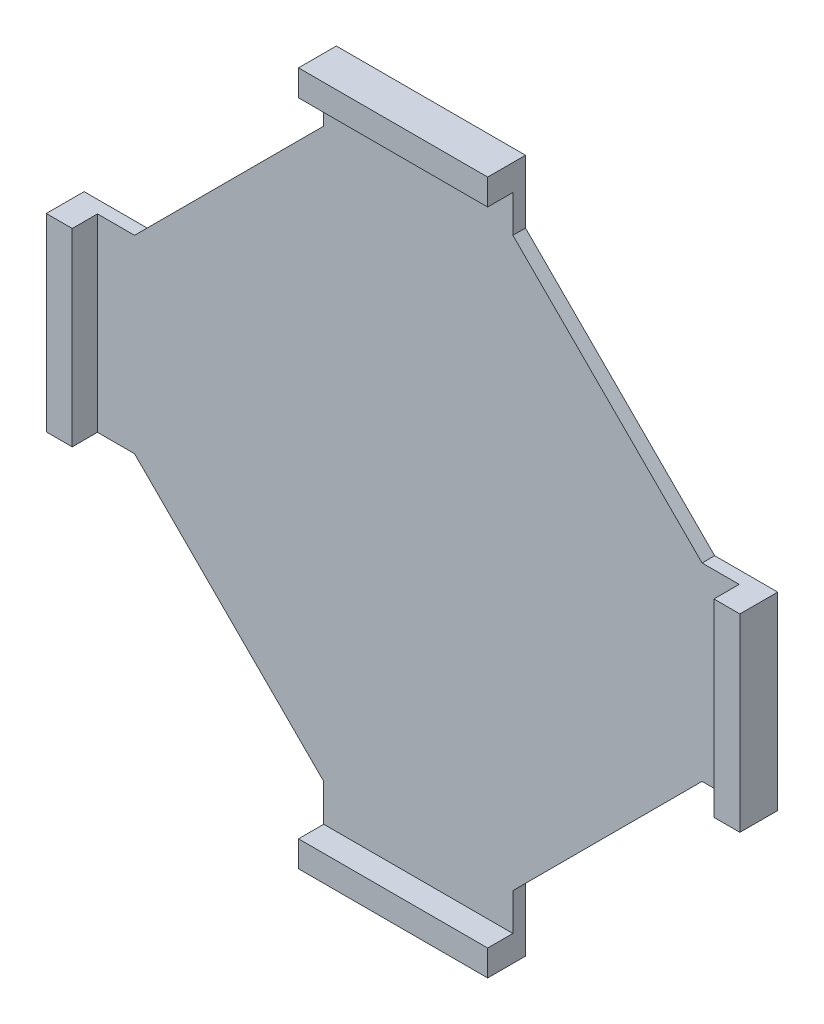
ISO-10303-21;
HEADER;
FILE_DESCRIPTION(('STEP AP214'),'2;1');
FILE_NAME('part.step','',(''),(''),'','','');
FILE_SCHEMA(('AUTOMOTIVE_DESIGN { 1 0 10303 214 1 1 1 1 }'));
ENDSEC;
DATA;
#1=APPLICATION_CONTEXT('core data for automotive mechanical design processes');
#2=APPLICATION_PROTOCOL_DEFINITION('international standard','automotive_design',2000,#1);
#3=PRODUCT_CONTEXT('',#1,'mechanical');
#4=PRODUCT('Part','Part','',(#3));
#5=PRODUCT_RELATED_PRODUCT_CATEGORY('part','',(#4));
#6=PRODUCT_DEFINITION_FORMATION('','',#4);
#7=PRODUCT_DEFINITION_CONTEXT('part definition',#1,'design');
#8=PRODUCT_DEFINITION('design','',#6,#7);
#9=PRODUCT_DEFINITION_SHAPE('','',#8);
#10=(LENGTH_UNIT() NAMED_UNIT(*) SI_UNIT(.MILLI.,.METRE.));
#11=(NAMED_UNIT(*) PLANE_ANGLE_UNIT() SI_UNIT($,.RADIAN.));
#12=(NAMED_UNIT(*) SI_UNIT($,.STERADIAN.) SOLID_ANGLE_UNIT());
#13=UNCERTAINTY_MEASURE_WITH_UNIT(LENGTH_MEASURE(1.E-05),#10,'distance_accuracy_value','');
#14=(GEOMETRIC_REPRESENTATION_CONTEXT(3) GLOBAL_UNCERTAINTY_ASSIGNED_CONTEXT((#13)) GLOBAL_UNIT_ASSIGNED_CONTEXT((#10,
#11,#12)) REPRESENTATION_CONTEXT('',''));
#15=CARTESIAN_POINT('',(0.,0.,0.));
#16=DIRECTION('',(0.,0.,1.));
#17=DIRECTION('',(1.,0.,0.));
#18=AXIS2_PLACEMENT_3D('',#15,#16,#17);
#19=CARTESIAN_POINT('',(0.,0.,2.54));
#20=DIRECTION('',(0.,0.,-1.));
#21=DIRECTION('',(-1.,0.,0.));
#22=AXIS2_PLACEMENT_3D('',#19,#20,#21);
#23=PLANE('',#22);
#24=DIRECTION('',(0.,-1.,0.));
#25=VECTOR('',#24,1.);
#26=CARTESIAN_POINT('',(64.6203075879521,-19.0500000000023,2.54));
#27=LINE('',#26,#25);
#28=CARTESIAN_POINT('',(64.6203075879525,19.0499999999977,2.54));
#29=VERTEX_POINT('',#28);
#30=CARTESIAN_POINT('',(64.6203075879521,-19.0499999999984,2.54));
#31=VERTEX_POINT('',#30);
#32=EDGE_CURVE('E221',#29,#31,#27,.T.);
#33=ORIENTED_EDGE('',*,*,#32,.F.);
#34=DIRECTION('',(-1.,0.,0.));
#35=VECTOR('',#34,1.);
#36=CARTESIAN_POINT('',(57.1499999999968,19.0500000000016,2.54));
#37=LINE('',#36,#35);
#38=CARTESIAN_POINT('',(57.1499999999968,19.0500000000016,2.54));
#39=VERTEX_POINT('',#38);
#40=EDGE_CURVE('E307',#29,#39,#37,.T.);
#41=ORIENTED_EDGE('',*,*,#40,.T.);
#42=DIRECTION('',(-0.707106781186548,0.707106781186547,0.));
#43=VECTOR('',#42,1.);
#44=CARTESIAN_POINT('',(19.0499999999984,57.15,2.54));
#45=LINE('',#44,#43);
#46=CARTESIAN_POINT('',(19.0499999999984,57.15,2.54));
#47=VERTEX_POINT('',#46);
#48=EDGE_CURVE('E309',#39,#47,#45,.T.);
#49=ORIENTED_EDGE('',*,*,#48,.T.);
#50=DIRECTION('',(0.,1.,0.));
#51=VECTOR('',#50,1.);
#52=CARTESIAN_POINT('',(19.0499999999984,57.15,2.54));
#53=LINE('',#52,#51);
#54=CARTESIAN_POINT('',(19.0499999999984,64.6203075879522,2.54));
#55=VERTEX_POINT('',#54);
#56=EDGE_CURVE('E55',#47,#55,#53,.T.);
#57=ORIENTED_EDGE('',*,*,#56,.T.);
#58=DIRECTION('',(1.,0.,0.));
#59=VECTOR('',#58,1.);
#60=CARTESIAN_POINT('',(19.050000000002,64.6203075879522,2.54));
#61=LINE('',#60,#59);
#62=CARTESIAN_POINT('',(-19.049999999998,64.6203075879525,2.54));
#63=VERTEX_POINT('',#62);
#64=EDGE_CURVE('E231',#63,#55,#61,.T.);
#65=ORIENTED_EDGE('',*,*,#64,.F.);
#66=DIRECTION('',(0.,-1.,0.));
#67=VECTOR('',#66,1.);
#68=CARTESIAN_POINT('',(-19.0500000000016,57.15,2.54));
#69=LINE('',#68,#67);
#70=CARTESIAN_POINT('',(-19.0500000000016,57.15,2.54));
#71=VERTEX_POINT('',#70);
#72=EDGE_CURVE('E289',#63,#71,#69,.T.);
#73=ORIENTED_EDGE('',*,*,#72,.T.);
#74=DIRECTION('',(-0.707106781186547,-0.707106781186548,0.));
#75=VECTOR('',#74,1.);
#76=CARTESIAN_POINT('',(-57.15,19.0500000000016,2.54));
#77=LINE('',#76,#75);
#78=CARTESIAN_POINT('',(-57.15,19.0500000000016,2.54));
#79=VERTEX_POINT('',#78);
#80=EDGE_CURVE('E292',#71,#79,#77,.T.);
#81=ORIENTED_EDGE('',*,*,#80,.T.);
#82=DIRECTION('',(-1.,0.,0.));
#83=VECTOR('',#82,1.);
#84=CARTESIAN_POINT('',(-57.15,19.0500000000016,2.54));
#85=LINE('',#84,#83);
#86=CARTESIAN_POINT('',(-64.6203075879523,19.0500000000016,2.54));
#87=VERTEX_POINT('',#86);
#88=EDGE_CURVE('E294',#79,#87,#85,.T.);
#89=ORIENTED_EDGE('',*,*,#88,.T.);
#90=DIRECTION('',(0.,1.,0.));
#91=VECTOR('',#90,1.);
#92=CARTESIAN_POINT('',(-64.6203075879523,19.0500000000018,2.54));
#93=LINE('',#92,#91);
#94=CARTESIAN_POINT('',(-64.6203075879524,-19.0499999999982,2.54));
#95=VERTEX_POINT('',#94);
#96=EDGE_CURVE('E249',#95,#87,#93,.T.);
#97=ORIENTED_EDGE('',*,*,#96,.F.);
#98=DIRECTION('',(1.,0.,0.));
#99=VECTOR('',#98,1.);
#100=CARTESIAN_POINT('',(-57.15,-19.0499999999984,2.54));
#101=LINE('',#100,#99);
#102=CARTESIAN_POINT('',(-57.15,-19.0499999999984,2.54));
#103=VERTEX_POINT('',#102);
#104=EDGE_CURVE('E296',#95,#103,#101,.T.);
#105=ORIENTED_EDGE('',*,*,#104,.T.);
#106=DIRECTION('',(0.707106781186548,-0.707106781186547,0.));
#107=VECTOR('',#106,1.);
#108=CARTESIAN_POINT('',(-19.0500000000016,-57.1499999999968,2.54));
#109=LINE('',#108,#107);
#110=CARTESIAN_POINT('',(-19.0500000000016,-57.1499999999968,2.54));
#111=VERTEX_POINT('',#110);
#112=EDGE_CURVE('E298',#103,#111,#109,.T.);
#113=ORIENTED_EDGE('',*,*,#112,.T.);
#114=DIRECTION('',(0.,-1.,0.));
#115=VECTOR('',#114,1.);
#116=CARTESIAN_POINT('',(-19.0500000000016,-57.1499999999968,2.54));
#117=LINE('',#116,#115);
#118=CARTESIAN_POINT('',(-19.0500000000016,-64.6203075879523,2.54));
#119=VERTEX_POINT('',#118);
#120=EDGE_CURVE('E300',#111,#119,#117,.T.);
#121=ORIENTED_EDGE('',*,*,#120,.T.);
#122=DIRECTION('',(-1.,0.,0.));
#123=VECTOR('',#122,1.);
#124=CARTESIAN_POINT('',(-19.0500000000016,-64.6203075879523,2.54));
#125=LINE('',#124,#123);
#126=CARTESIAN_POINT('',(19.0499999999984,-64.6203075879523,2.54));
#127=VERTEX_POINT('',#126);
#128=EDGE_CURVE('E268',#127,#119,#125,.T.);
#129=ORIENTED_EDGE('',*,*,#128,.F.);
#130=DIRECTION('',(0.,1.,0.));
#131=VECTOR('',#130,1.);
#132=CARTESIAN_POINT('',(19.0499999999984,-57.1499999999968,2.54));
#133=LINE('',#132,#131);
#134=CARTESIAN_POINT('',(19.0499999999984,-57.1499999999968,2.54));
#135=VERTEX_POINT('',#134);
#136=EDGE_CURVE('E302',#127,#135,#133,.T.);
#137=ORIENTED_EDGE('',*,*,#136,.T.);
#138=DIRECTION('',(0.707106781186547,0.707106781186548,0.));
#139=VECTOR('',#138,1.);
#140=CARTESIAN_POINT('',(57.1499999999968,-19.0499999999984,2.54));
#141=LINE('',#140,#139);
#142=CARTESIAN_POINT('',(57.1499999999968,-19.0499999999984,2.54));
#143=VERTEX_POINT('',#142);
#144=EDGE_CURVE('E304',#135,#143,#141,.T.);
#145=ORIENTED_EDGE('',*,*,#144,.T.);
#146=DIRECTION('',(1.,0.,0.));
#147=VECTOR('',#146,1.);
#148=CARTESIAN_POINT('',(57.1499999999968,-19.0499999999984,2.54));
#149=LINE('',#148,#147);
#150=EDGE_CURVE('E48',#143,#31,#149,.T.);
#151=ORIENTED_EDGE('',*,*,#150,.T.);
#152=EDGE_LOOP('',(#33,#41,#49,#57,#65,#73,#81,#89,#97,#105,#113,#121,#129,#137,#145,#151));
#153=FACE_BOUND('',#152,.T.);
#154=ADVANCED_FACE('F33',(#153),#23,.F.);
#155=CARTESIAN_POINT('',(19.0499999999984,57.15,2.54));
#156=DIRECTION('',(-1.,0.,0.));
#157=DIRECTION('',(0.,0.,1.));
#158=AXIS2_PLACEMENT_3D('',#155,#156,#157);
#159=PLANE('',#158);
#160=DIRECTION('',(0.,1.,0.));
#161=VECTOR('',#160,1.);
#162=CARTESIAN_POINT('',(19.0499999999984,57.15,0.));
#163=LINE('',#162,#161);
#164=CARTESIAN_POINT('',(19.0499999999984,57.15,0.));
#165=VERTEX_POINT('',#164);
#166=CARTESIAN_POINT('',(19.0499999999984,69.85,0.));
#167=VERTEX_POINT('',#166);
#168=EDGE_CURVE('E287',#165,#167,#163,.T.);
#169=ORIENTED_EDGE('',*,*,#168,.T.);
#170=DIRECTION('',(0.,0.,-1.));
#171=VECTOR('',#170,1.);
#172=CARTESIAN_POINT('',(19.0499999999984,69.85,2.54));
#173=LINE('',#172,#171);
#174=CARTESIAN_POINT('',(19.0500000000021,69.8499999999967,7.62));
#175=VERTEX_POINT('',#174);
#176=EDGE_CURVE('E11',#175,#167,#173,.T.);
#177=ORIENTED_EDGE('',*,*,#176,.F.);
#178=DIRECTION('',(0.,1.,0.));
#179=VECTOR('',#178,1.);
#180=CARTESIAN_POINT('',(19.0500000000021,69.8499999999967,7.62));
#181=LINE('',#180,#179);
#182=CARTESIAN_POINT('',(19.050000000002,64.6203075879522,7.62));
#183=VERTEX_POINT('',#182);
#184=EDGE_CURVE('E239',#183,#175,#181,.T.);
#185=ORIENTED_EDGE('',*,*,#184,.F.);
#186=DIRECTION('',(0.,0.,-1.));
#187=VECTOR('',#186,1.);
#188=CARTESIAN_POINT('',(19.050000000002,64.6203075879522,7.62));
#189=LINE('',#188,#187);
#190=EDGE_CURVE('E242',#183,#55,#189,.T.);
#191=ORIENTED_EDGE('',*,*,#190,.T.);
#192=ORIENTED_EDGE('',*,*,#56,.F.);
#193=DIRECTION('',(0.,0.,-1.));
#194=VECTOR('',#193,1.);
#195=CARTESIAN_POINT('',(19.0499999999984,57.15,2.54));
#196=LINE('',#195,#194);
#197=EDGE_CURVE('E311',#47,#165,#196,.T.);
#198=ORIENTED_EDGE('',*,*,#197,.T.);
#199=EDGE_LOOP('',(#169,#177,#185,#191,#192,#198));
#200=FACE_BOUND('',#199,.T.);
#201=ADVANCED_FACE('F35',(#200),#159,.F.);
#202=CARTESIAN_POINT('',(-19.0500000000016,69.85,2.54));
#203=DIRECTION('',(0.,-1.,0.));
#204=DIRECTION('',(1.,0.,0.));
#205=AXIS2_PLACEMENT_3D('',#202,#203,#204);
#206=PLANE('',#205);
#207=DIRECTION('',(-1.,0.,0.));
#208=VECTOR('',#207,1.);
#209=CARTESIAN_POINT('',(-19.0500000000016,69.85,0.));
#210=LINE('',#209,#208);
#211=CARTESIAN_POINT('',(-19.0500000000016,69.85,0.));
#212=VERTEX_POINT('',#211);
#213=EDGE_CURVE('E314',#167,#212,#210,.T.);
#214=ORIENTED_EDGE('',*,*,#213,.T.);
#215=DIRECTION('',(0.,0.,-1.));
#216=VECTOR('',#215,1.);
#217=CARTESIAN_POINT('',(-19.0500000000016,69.85,2.54));
#218=LINE('',#217,#216);
#219=CARTESIAN_POINT('',(-19.0499999999979,69.849999999997,7.62));
#220=VERTEX_POINT('',#219);
#221=EDGE_CURVE('E41',#220,#212,#218,.T.);
#222=ORIENTED_EDGE('',*,*,#221,.F.);
#223=DIRECTION('',(-1.,0.,0.));
#224=VECTOR('',#223,1.);
#225=CARTESIAN_POINT('',(19.0500000000021,69.8499999999967,7.62));
#226=LINE('',#225,#224);
#227=EDGE_CURVE('E232',#175,#220,#226,.T.);
#228=ORIENTED_EDGE('',*,*,#227,.F.);
#229=ORIENTED_EDGE('',*,*,#176,.T.);
#230=EDGE_LOOP('',(#214,#222,#228,#229));
#231=FACE_BOUND('',#230,.T.);
#232=ADVANCED_FACE('F455',(#231),#206,.F.);
#233=CARTESIAN_POINT('',(-19.0500000000016,57.15,2.54));
#234=DIRECTION('',(1.,0.,0.));
#235=DIRECTION('',(0.,0.,-1.));
#236=AXIS2_PLACEMENT_3D('',#233,#234,#235);
#237=PLANE('',#236);
#238=DIRECTION('',(0.,-1.,0.));
#239=VECTOR('',#238,1.);
#240=CARTESIAN_POINT('',(-19.0500000000016,57.15,0.));
#241=LINE('',#240,#239);
#242=CARTESIAN_POINT('',(-19.0500000000016,57.15,0.));
#243=VERTEX_POINT('',#242);
#244=EDGE_CURVE('E316',#212,#243,#241,.T.);
#245=ORIENTED_EDGE('',*,*,#244,.T.);
#246=DIRECTION('',(0.,0.,-1.));
#247=VECTOR('',#246,1.);
#248=CARTESIAN_POINT('',(-19.0500000000016,57.15,2.54));
#249=LINE('',#248,#247);
#250=EDGE_CURVE('E374',#71,#243,#249,.T.);
#251=ORIENTED_EDGE('',*,*,#250,.F.);
#252=ORIENTED_EDGE('',*,*,#72,.F.);
#253=DIRECTION('',(0.,0.,-1.));
#254=VECTOR('',#253,1.);
#255=CARTESIAN_POINT('',(-19.049999999998,64.6203075879525,7.62));
#256=LINE('',#255,#254);
#257=CARTESIAN_POINT('',(-19.049999999998,64.6203075879525,7.62));
#258=VERTEX_POINT('',#257);
#259=EDGE_CURVE('E246',#258,#63,#256,.T.);
#260=ORIENTED_EDGE('',*,*,#259,.F.);
#261=DIRECTION('',(0.,-1.,0.));
#262=VECTOR('',#261,1.);
#263=CARTESIAN_POINT('',(-19.0499999999979,69.849999999997,7.62));
#264=LINE('',#263,#262);
#265=EDGE_CURVE('E235',#220,#258,#264,.T.);
#266=ORIENTED_EDGE('',*,*,#265,.F.);
#267=ORIENTED_EDGE('',*,*,#221,.T.);
#268=EDGE_LOOP('',(#245,#251,#252,#260,#266,#267));
#269=FACE_BOUND('',#268,.T.);
#270=ADVANCED_FACE('F380',(#269),#237,.F.);
#271=CARTESIAN_POINT('',(-57.15,19.0500000000016,2.54));
#272=DIRECTION('',(0.707106781186548,-0.707106781186547,0.));
#273=DIRECTION('',(0.707106781186547,0.707106781186548,0.));
#274=AXIS2_PLACEMENT_3D('',#271,#272,#273);
#275=PLANE('',#274);
#276=DIRECTION('',(-0.707106781186547,-0.707106781186548,0.));
#277=VECTOR('',#276,1.);
#278=CARTESIAN_POINT('',(-57.15,19.0500000000016,0.));
#279=LINE('',#278,#277);
#280=CARTESIAN_POINT('',(-57.15,19.0500000000016,0.));
#281=VERTEX_POINT('',#280);
#282=EDGE_CURVE('E318',#243,#281,#279,.T.);
#283=ORIENTED_EDGE('',*,*,#282,.T.);
#284=DIRECTION('',(0.,0.,-1.));
#285=VECTOR('',#284,1.);
#286=CARTESIAN_POINT('',(-57.15,19.0500000000016,2.54));
#287=LINE('',#286,#285);
#288=EDGE_CURVE('E371',#79,#281,#287,.T.);
#289=ORIENTED_EDGE('',*,*,#288,.F.);
#290=ORIENTED_EDGE('',*,*,#80,.F.);
#291=ORIENTED_EDGE('',*,*,#250,.T.);
#292=EDGE_LOOP('',(#283,#289,#290,#291));
#293=FACE_BOUND('',#292,.T.);
#294=ADVANCED_FACE('F393',(#293),#275,.F.);
#295=CARTESIAN_POINT('',(-57.15,19.0500000000016,2.54));
#296=DIRECTION('',(0.,-1.,0.));
#297=DIRECTION('',(1.,0.,0.));
#298=AXIS2_PLACEMENT_3D('',#295,#296,#297);
#299=PLANE('',#298);
#300=DIRECTION('',(-1.,0.,0.));
#301=VECTOR('',#300,1.);
#302=CARTESIAN_POINT('',(-57.15,19.0500000000016,0.));
#303=LINE('',#302,#301);
#304=CARTESIAN_POINT('',(-69.85,19.0500000000016,0.));
#305=VERTEX_POINT('',#304);
#306=EDGE_CURVE('E320',#281,#305,#303,.T.);
#307=ORIENTED_EDGE('',*,*,#306,.T.);
#308=DIRECTION('',(0.,0.,-1.));
#309=VECTOR('',#308,1.);
#310=CARTESIAN_POINT('',(-69.85,19.0500000000016,2.54));
#311=LINE('',#310,#309);
#312=CARTESIAN_POINT('',(-69.8499999999968,19.0500000000018,7.62));
#313=VERTEX_POINT('',#312);
#314=EDGE_CURVE('E368',#313,#305,#311,.T.);
#315=ORIENTED_EDGE('',*,*,#314,.F.);
#316=DIRECTION('',(-1.,0.,0.));
#317=VECTOR('',#316,1.);
#318=CARTESIAN_POINT('',(-69.8499999999968,19.0500000000018,7.62));
#319=LINE('',#318,#317);
#320=CARTESIAN_POINT('',(-64.6203075879523,19.0500000000018,7.62));
#321=VERTEX_POINT('',#320);
#322=EDGE_CURVE('E257',#321,#313,#319,.T.);
#323=ORIENTED_EDGE('',*,*,#322,.F.);
#324=DIRECTION('',(0.,0.,-1.));
#325=VECTOR('',#324,1.);
#326=CARTESIAN_POINT('',(-64.6203075879523,19.0500000000018,7.62));
#327=LINE('',#326,#325);
#328=EDGE_CURVE('E260',#321,#87,#327,.T.);
#329=ORIENTED_EDGE('',*,*,#328,.T.);
#330=ORIENTED_EDGE('',*,*,#88,.F.);
#331=ORIENTED_EDGE('',*,*,#288,.T.);
#332=EDGE_LOOP('',(#307,#315,#323,#329,#330,#331));
#333=FACE_BOUND('',#332,.T.);
#334=ADVANCED_FACE('F397',(#333),#299,.F.);
#335=CARTESIAN_POINT('',(-69.85,-19.0499999999984,2.54));
#336=DIRECTION('',(1.,0.,0.));
#337=DIRECTION('',(0.,1.,0.));
#338=AXIS2_PLACEMENT_3D('',#335,#336,#337);
#339=PLANE('',#338);
#340=DIRECTION('',(0.,-1.,0.));
#341=VECTOR('',#340,1.);
#342=CARTESIAN_POINT('',(-69.85,-19.0499999999984,0.));
#343=LINE('',#342,#341);
#344=CARTESIAN_POINT('',(-69.85,-19.0499999999984,0.));
#345=VERTEX_POINT('',#344);
#346=EDGE_CURVE('E322',#305,#345,#343,.T.);
#347=ORIENTED_EDGE('',*,*,#346,.T.);
#348=DIRECTION('',(0.,0.,-1.));
#349=VECTOR('',#348,1.);
#350=CARTESIAN_POINT('',(-69.85,-19.0499999999984,2.54));
#351=LINE('',#350,#349);
#352=CARTESIAN_POINT('',(-69.8499999999969,-19.0499999999982,7.62));
#353=VERTEX_POINT('',#352);
#354=EDGE_CURVE('E365',#353,#345,#351,.T.);
#355=ORIENTED_EDGE('',*,*,#354,.F.);
#356=DIRECTION('',(0.,-1.,0.));
#357=VECTOR('',#356,1.);
#358=CARTESIAN_POINT('',(-69.8499999999968,19.0500000000018,7.62));
#359=LINE('',#358,#357);
#360=EDGE_CURVE('E250',#313,#353,#359,.T.);
#361=ORIENTED_EDGE('',*,*,#360,.F.);
#362=ORIENTED_EDGE('',*,*,#314,.T.);
#363=EDGE_LOOP('',(#347,#355,#361,#362));
#364=FACE_BOUND('',#363,.T.);
#365=ADVANCED_FACE('F499',(#364),#339,.F.);
#366=CARTESIAN_POINT('',(-57.15,-19.0499999999984,2.54));
#367=DIRECTION('',(0.,1.,0.));
#368=DIRECTION('',(-1.,0.,0.));
#369=AXIS2_PLACEMENT_3D('',#366,#367,#368);
#370=PLANE('',#369);
#371=DIRECTION('',(1.,0.,0.));
#372=VECTOR('',#371,1.);
#373=CARTESIAN_POINT('',(-57.15,-19.0499999999984,0.));
#374=LINE('',#373,#372);
#375=CARTESIAN_POINT('',(-57.15,-19.0499999999984,0.));
#376=VERTEX_POINT('',#375);
#377=EDGE_CURVE('E324',#345,#376,#374,.T.);
#378=ORIENTED_EDGE('',*,*,#377,.T.);
#379=DIRECTION('',(0.,0.,-1.));
#380=VECTOR('',#379,1.);
#381=CARTESIAN_POINT('',(-57.15,-19.0499999999984,2.54));
#382=LINE('',#381,#380);
#383=EDGE_CURVE('E362',#103,#376,#382,.T.);
#384=ORIENTED_EDGE('',*,*,#383,.F.);
#385=ORIENTED_EDGE('',*,*,#104,.F.);
#386=DIRECTION('',(0.,0.,-1.));
#387=VECTOR('',#386,1.);
#388=CARTESIAN_POINT('',(-64.6203075879524,-19.0499999999982,7.62));
#389=LINE('',#388,#387);
#390=CARTESIAN_POINT('',(-64.6203075879524,-19.0499999999982,7.62));
#391=VERTEX_POINT('',#390);
#392=EDGE_CURVE('E265',#391,#95,#389,.T.);
#393=ORIENTED_EDGE('',*,*,#392,.F.);
#394=DIRECTION('',(1.,0.,0.));
#395=VECTOR('',#394,1.);
#396=CARTESIAN_POINT('',(-69.8499999999969,-19.0499999999982,7.62));
#397=LINE('',#396,#395);
#398=EDGE_CURVE('E253',#353,#391,#397,.T.);
#399=ORIENTED_EDGE('',*,*,#398,.F.);
#400=ORIENTED_EDGE('',*,*,#354,.T.);
#401=EDGE_LOOP('',(#378,#384,#385,#393,#399,#400));
#402=FACE_BOUND('',#401,.T.);
#403=ADVANCED_FACE('F407',(#402),#370,.F.);
#404=CARTESIAN_POINT('',(-19.0500000000016,-57.1499999999968,2.54));
#405=DIRECTION('',(0.707106781186547,0.707106781186548,0.));
#406=DIRECTION('',(-0.707106781186548,0.707106781186547,0.));
#407=AXIS2_PLACEMENT_3D('',#404,#405,#406);
#408=PLANE('',#407);
#409=DIRECTION('',(0.707106781186548,-0.707106781186547,0.));
#410=VECTOR('',#409,1.);
#411=CARTESIAN_POINT('',(-19.0500000000016,-57.1499999999968,0.));
#412=LINE('',#411,#410);
#413=CARTESIAN_POINT('',(-19.0500000000016,-57.1499999999968,0.));
#414=VERTEX_POINT('',#413);
#415=EDGE_CURVE('E326',#376,#414,#412,.T.);
#416=ORIENTED_EDGE('',*,*,#415,.T.);
#417=DIRECTION('',(0.,0.,-1.));
#418=VECTOR('',#417,1.);
#419=CARTESIAN_POINT('',(-19.0500000000016,-57.1499999999968,2.54));
#420=LINE('',#419,#418);
#421=EDGE_CURVE('E359',#111,#414,#420,.T.);
#422=ORIENTED_EDGE('',*,*,#421,.F.);
#423=ORIENTED_EDGE('',*,*,#112,.F.);
#424=ORIENTED_EDGE('',*,*,#383,.T.);
#425=EDGE_LOOP('',(#416,#422,#423,#424));
#426=FACE_BOUND('',#425,.T.);
#427=ADVANCED_FACE('F413',(#426),#408,.F.);
#428=CARTESIAN_POINT('',(-19.0500000000016,-57.1499999999968,2.54));
#429=DIRECTION('',(1.,0.,0.));
#430=DIRECTION('',(0.,0.,-1.));
#431=AXIS2_PLACEMENT_3D('',#428,#429,#430);
#432=PLANE('',#431);
#433=DIRECTION('',(0.,-1.,0.));
#434=VECTOR('',#433,1.);
#435=CARTESIAN_POINT('',(-19.0500000000016,-57.1499999999968,0.));
#436=LINE('',#435,#434);
#437=CARTESIAN_POINT('',(-19.0500000000016,-69.8499999999968,0.));
#438=VERTEX_POINT('',#437);
#439=EDGE_CURVE('E328',#414,#438,#436,.T.);
#440=ORIENTED_EDGE('',*,*,#439,.T.);
#441=DIRECTION('',(0.,0.,-1.));
#442=VECTOR('',#441,1.);
#443=CARTESIAN_POINT('',(-19.0500000000016,-69.8499999999968,2.54));
#444=LINE('',#443,#442);
#445=CARTESIAN_POINT('',(-19.0500000000016,-69.8499999999968,7.62));
#446=VERTEX_POINT('',#445);
#447=EDGE_CURVE('E356',#446,#438,#444,.T.);
#448=ORIENTED_EDGE('',*,*,#447,.F.);
#449=DIRECTION('',(0.,-1.,0.));
#450=VECTOR('',#449,1.);
#451=CARTESIAN_POINT('',(-19.0500000000016,-69.8499999999968,7.62));
#452=LINE('',#451,#450);
#453=CARTESIAN_POINT('',(-19.0500000000016,-64.6203075879523,7.62));
#454=VERTEX_POINT('',#453);
#455=EDGE_CURVE('E269',#454,#446,#452,.T.);
#456=ORIENTED_EDGE('',*,*,#455,.F.);
#457=DIRECTION('',(0.,0.,-1.));
#458=VECTOR('',#457,1.);
#459=CARTESIAN_POINT('',(-19.0500000000016,-64.6203075879523,7.62));
#460=LINE('',#459,#458);
#461=EDGE_CURVE('E279',#454,#119,#460,.T.);
#462=ORIENTED_EDGE('',*,*,#461,.T.);
#463=ORIENTED_EDGE('',*,*,#120,.F.);
#464=ORIENTED_EDGE('',*,*,#421,.T.);
#465=EDGE_LOOP('',(#440,#448,#456,#462,#463,#464));
#466=FACE_BOUND('',#465,.T.);
#467=ADVANCED_FACE('F417',(#466),#432,.F.);
#468=CARTESIAN_POINT('',(19.0499999999984,-69.8499999999968,2.54));
#469=DIRECTION('',(0.,1.,0.));
#470=DIRECTION('',(-1.,0.,0.));
#471=AXIS2_PLACEMENT_3D('',#468,#469,#470);
#472=PLANE('',#471);
#473=DIRECTION('',(1.,0.,0.));
#474=VECTOR('',#473,1.);
#475=CARTESIAN_POINT('',(19.0499999999984,-69.8499999999968,0.));
#476=LINE('',#475,#474);
#477=CARTESIAN_POINT('',(19.0499999999984,-69.8499999999968,0.));
#478=VERTEX_POINT('',#477);
#479=EDGE_CURVE('E330',#438,#478,#476,.T.);
#480=ORIENTED_EDGE('',*,*,#479,.T.);
#481=DIRECTION('',(0.,0.,-1.));
#482=VECTOR('',#481,1.);
#483=CARTESIAN_POINT('',(19.0499999999984,-69.8499999999968,2.54));
#484=LINE('',#483,#482);
#485=CARTESIAN_POINT('',(19.0499999999984,-69.8499999999968,7.62));
#486=VERTEX_POINT('',#485);
#487=EDGE_CURVE('E353',#486,#478,#484,.T.);
#488=ORIENTED_EDGE('',*,*,#487,.F.);
#489=DIRECTION('',(1.,0.,0.));
#490=VECTOR('',#489,1.);
#491=CARTESIAN_POINT('',(-19.0500000000016,-69.8499999999968,7.62));
#492=LINE('',#491,#490);
#493=EDGE_CURVE('E272',#446,#486,#492,.T.);
#494=ORIENTED_EDGE('',*,*,#493,.F.);
#495=ORIENTED_EDGE('',*,*,#447,.T.);
#496=EDGE_LOOP('',(#480,#488,#494,#495));
#497=FACE_BOUND('',#496,.T.);
#498=ADVANCED_FACE('F458',(#497),#472,.F.);
#499=CARTESIAN_POINT('',(19.0499999999984,-57.1499999999968,2.54));
#500=DIRECTION('',(-1.,0.,0.));
#501=DIRECTION('',(0.,0.,1.));
#502=AXIS2_PLACEMENT_3D('',#499,#500,#501);
#503=PLANE('',#502);
#504=DIRECTION('',(0.,1.,0.));
#505=VECTOR('',#504,1.);
#506=CARTESIAN_POINT('',(19.0499999999984,-57.1499999999968,0.));
#507=LINE('',#506,#505);
#508=CARTESIAN_POINT('',(19.0499999999984,-57.1499999999968,0.));
#509=VERTEX_POINT('',#508);
#510=EDGE_CURVE('E332',#478,#509,#507,.T.);
#511=ORIENTED_EDGE('',*,*,#510,.T.);
#512=DIRECTION('',(0.,0.,-1.));
#513=VECTOR('',#512,1.);
#514=CARTESIAN_POINT('',(19.0499999999984,-57.1499999999968,2.54));
#515=LINE('',#514,#513);
#516=EDGE_CURVE('E350',#135,#509,#515,.T.);
#517=ORIENTED_EDGE('',*,*,#516,.F.);
#518=ORIENTED_EDGE('',*,*,#136,.F.);
#519=DIRECTION('',(0.,0.,-1.));
#520=VECTOR('',#519,1.);
#521=CARTESIAN_POINT('',(19.0499999999984,-64.6203075879523,7.62));
#522=LINE('',#521,#520);
#523=CARTESIAN_POINT('',(19.0499999999984,-64.6203075879523,7.62));
#524=VERTEX_POINT('',#523);
#525=EDGE_CURVE('E284',#524,#127,#522,.T.);
#526=ORIENTED_EDGE('',*,*,#525,.F.);
#527=DIRECTION('',(0.,1.,0.));
#528=VECTOR('',#527,1.);
#529=CARTESIAN_POINT('',(19.0499999999984,-69.8499999999968,7.62));
#530=LINE('',#529,#528);
#531=EDGE_CURVE('E275',#486,#524,#530,.T.);
#532=ORIENTED_EDGE('',*,*,#531,.F.);
#533=ORIENTED_EDGE('',*,*,#487,.T.);
#534=EDGE_LOOP('',(#511,#517,#518,#526,#532,#533));
#535=FACE_BOUND('',#534,.T.);
#536=ADVANCED_FACE('F427',(#535),#503,.F.);
#537=CARTESIAN_POINT('',(57.1499999999968,-19.0499999999984,2.54));
#538=DIRECTION('',(-0.707106781186548,0.707106781186547,0.));
#539=DIRECTION('',(-0.707106781186547,-0.707106781186548,0.));
#540=AXIS2_PLACEMENT_3D('',#537,#538,#539);
#541=PLANE('',#540);
#542=DIRECTION('',(0.707106781186547,0.707106781186548,0.));
#543=VECTOR('',#542,1.);
#544=CARTESIAN_POINT('',(57.1499999999968,-19.0499999999984,0.));
#545=LINE('',#544,#543);
#546=CARTESIAN_POINT('',(57.1499999999968,-19.0499999999984,0.));
#547=VERTEX_POINT('',#546);
#548=EDGE_CURVE('E334',#509,#547,#545,.T.);
#549=ORIENTED_EDGE('',*,*,#548,.T.);
#550=DIRECTION('',(0.,0.,-1.));
#551=VECTOR('',#550,1.);
#552=CARTESIAN_POINT('',(57.1499999999968,-19.0499999999984,2.54));
#553=LINE('',#552,#551);
#554=EDGE_CURVE('E347',#143,#547,#553,.T.);
#555=ORIENTED_EDGE('',*,*,#554,.F.);
#556=ORIENTED_EDGE('',*,*,#144,.F.);
#557=ORIENTED_EDGE('',*,*,#516,.T.);
#558=EDGE_LOOP('',(#549,#555,#556,#557));
#559=FACE_BOUND('',#558,.T.);
#560=ADVANCED_FACE('F434',(#559),#541,.F.);
#561=CARTESIAN_POINT('',(57.1499999999968,-19.0499999999984,2.54));
#562=DIRECTION('',(0.,1.,0.));
#563=DIRECTION('',(0.,0.,1.));
#564=AXIS2_PLACEMENT_3D('',#561,#562,#563);
#565=PLANE('',#564);
#566=DIRECTION('',(1.,0.,0.));
#567=VECTOR('',#566,1.);
#568=CARTESIAN_POINT('',(57.1499999999968,-19.0499999999984,0.));
#569=LINE('',#568,#567);
#570=CARTESIAN_POINT('',(69.8499999999968,-19.0499999999984,0.));
#571=VERTEX_POINT('',#570);
#572=EDGE_CURVE('E336',#547,#571,#569,.T.);
#573=ORIENTED_EDGE('',*,*,#572,.T.);
#574=DIRECTION('',(0.,0.,-1.));
#575=VECTOR('',#574,1.);
#576=CARTESIAN_POINT('',(69.8499999999968,-19.0499999999984,2.54));
#577=LINE('',#576,#575);
#578=CARTESIAN_POINT('',(69.8499999999966,-19.0500000000023,7.62));
#579=VERTEX_POINT('',#578);
#580=EDGE_CURVE('E205',#579,#571,#577,.T.);
#581=ORIENTED_EDGE('',*,*,#580,.F.);
#582=DIRECTION('',(1.,0.,0.));
#583=VECTOR('',#582,1.);
#584=CARTESIAN_POINT('',(69.8499999999966,-19.0500000000023,7.62));
#585=LINE('',#584,#583);
#586=CARTESIAN_POINT('',(64.6203075879521,-19.0500000000023,7.62));
#587=VERTEX_POINT('',#586);
#588=EDGE_CURVE('E220',#587,#579,#585,.T.);
#589=ORIENTED_EDGE('',*,*,#588,.F.);
#590=DIRECTION('',(0.,0.,-1.));
#591=VECTOR('',#590,1.);
#592=CARTESIAN_POINT('',(64.6203075879521,-19.0500000000023,7.62));
#593=LINE('',#592,#591);
#594=EDGE_CURVE('E226',#587,#31,#593,.T.);
#595=ORIENTED_EDGE('',*,*,#594,.T.);
#596=ORIENTED_EDGE('',*,*,#150,.F.);
#597=ORIENTED_EDGE('',*,*,#554,.T.);
#598=EDGE_LOOP('',(#573,#581,#589,#595,#596,#597));
#599=FACE_BOUND('',#598,.T.);
#600=ADVANCED_FACE('F437',(#599),#565,.F.);
#601=CARTESIAN_POINT('',(69.8499999999968,-19.0499999999984,2.54));
#602=DIRECTION('',(-1.,0.,0.));
#603=DIRECTION('',(0.,-1.,0.));
#604=AXIS2_PLACEMENT_3D('',#601,#602,#603);
#605=PLANE('',#604);
#606=DIRECTION('',(0.,1.,0.));
#607=VECTOR('',#606,1.);
#608=CARTESIAN_POINT('',(69.8499999999968,-19.0499999999984,0.));
#609=LINE('',#608,#607);
#610=CARTESIAN_POINT('',(69.8499999999968,19.0500000000016,0.));
#611=VERTEX_POINT('',#610);
#612=EDGE_CURVE('E202',#571,#611,#609,.T.);
#613=ORIENTED_EDGE('',*,*,#612,.T.);
#614=DIRECTION('',(0.,0.,-1.));
#615=VECTOR('',#614,1.);
#616=CARTESIAN_POINT('',(69.8499999999968,19.0500000000016,2.54));
#617=LINE('',#616,#615);
#618=CARTESIAN_POINT('',(69.849999999997,19.0499999999977,7.62));
#619=VERTEX_POINT('',#618);
#620=EDGE_CURVE('E195',#619,#611,#617,.T.);
#621=ORIENTED_EDGE('',*,*,#620,.F.);
#622=DIRECTION('',(0.,1.,0.));
#623=VECTOR('',#622,1.);
#624=CARTESIAN_POINT('',(69.8499999999966,-19.0500000000023,7.62));
#625=LINE('',#624,#623);
#626=EDGE_CURVE('E200',#579,#619,#625,.T.);
#627=ORIENTED_EDGE('',*,*,#626,.F.);
#628=ORIENTED_EDGE('',*,*,#580,.T.);
#629=EDGE_LOOP('',(#613,#621,#627,#628));
#630=FACE_BOUND('',#629,.T.);
#631=ADVANCED_FACE('F197',(#630),#605,.F.);
#632=CARTESIAN_POINT('',(57.1499999999968,19.0500000000016,2.54));
#633=DIRECTION('',(0.,-1.,0.));
#634=DIRECTION('',(0.,0.,-1.));
#635=AXIS2_PLACEMENT_3D('',#632,#633,#634);
#636=PLANE('',#635);
#637=DIRECTION('',(-1.,0.,0.));
#638=VECTOR('',#637,1.);
#639=CARTESIAN_POINT('',(57.1499999999968,19.0500000000016,0.));
#640=LINE('',#639,#638);
#641=CARTESIAN_POINT('',(57.1499999999968,19.0500000000016,0.));
#642=VERTEX_POINT('',#641);
#643=EDGE_CURVE('E339',#611,#642,#640,.T.);
#644=ORIENTED_EDGE('',*,*,#643,.T.);
#645=DIRECTION('',(0.,0.,-1.));
#646=VECTOR('',#645,1.);
#647=CARTESIAN_POINT('',(57.1499999999968,19.0500000000016,2.54));
#648=LINE('',#647,#646);
#649=EDGE_CURVE('E206',#39,#642,#648,.T.);
#650=ORIENTED_EDGE('',*,*,#649,.F.);
#651=ORIENTED_EDGE('',*,*,#40,.F.);
#652=DIRECTION('',(0.,0.,-1.));
#653=VECTOR('',#652,1.);
#654=CARTESIAN_POINT('',(64.6203075879525,19.0499999999977,7.62));
#655=LINE('',#654,#653);
#656=CARTESIAN_POINT('',(64.6203075879525,19.0499999999977,7.62));
#657=VERTEX_POINT('',#656);
#658=EDGE_CURVE('E212',#657,#29,#655,.T.);
#659=ORIENTED_EDGE('',*,*,#658,.F.);
#660=DIRECTION('',(-1.,0.,0.));
#661=VECTOR('',#660,1.);
#662=CARTESIAN_POINT('',(69.849999999997,19.0499999999977,7.62));
#663=LINE('',#662,#661);
#664=EDGE_CURVE('E209',#619,#657,#663,.T.);
#665=ORIENTED_EDGE('',*,*,#664,.F.);
#666=ORIENTED_EDGE('',*,*,#620,.T.);
#667=EDGE_LOOP('',(#644,#650,#651,#659,#665,#666));
#668=FACE_BOUND('',#667,.T.);
#669=ADVANCED_FACE('F210',(#668),#636,.F.);
#670=CARTESIAN_POINT('',(19.0499999999984,57.15,2.54));
#671=DIRECTION('',(-0.707106781186547,-0.707106781186548,0.));
#672=DIRECTION('',(0.707106781186548,-0.707106781186547,0.));
#673=AXIS2_PLACEMENT_3D('',#670,#671,#672);
#674=PLANE('',#673);
#675=DIRECTION('',(-0.707106781186548,0.707106781186547,0.));
#676=VECTOR('',#675,1.);
#677=CARTESIAN_POINT('',(19.0499999999984,57.15,0.));
#678=LINE('',#677,#676);
#679=EDGE_CURVE('E290',#642,#165,#678,.T.);
#680=ORIENTED_EDGE('',*,*,#679,.T.);
#681=ORIENTED_EDGE('',*,*,#197,.F.);
#682=ORIENTED_EDGE('',*,*,#48,.F.);
#683=ORIENTED_EDGE('',*,*,#649,.T.);
#684=EDGE_LOOP('',(#680,#681,#682,#683));
#685=FACE_BOUND('',#684,.T.);
#686=ADVANCED_FACE('F446',(#685),#674,.F.);
#687=CARTESIAN_POINT('',(0.,0.,0.));
#688=DIRECTION('',(0.,0.,-1.));
#689=DIRECTION('',(-1.,0.,0.));
#690=AXIS2_PLACEMENT_3D('',#687,#688,#689);
#691=PLANE('',#690);
#692=ORIENTED_EDGE('',*,*,#168,.F.);
#693=ORIENTED_EDGE('',*,*,#679,.F.);
#694=ORIENTED_EDGE('',*,*,#643,.F.);
#695=ORIENTED_EDGE('',*,*,#612,.F.);
#696=ORIENTED_EDGE('',*,*,#572,.F.);
#697=ORIENTED_EDGE('',*,*,#548,.F.);
#698=ORIENTED_EDGE('',*,*,#510,.F.);
#699=ORIENTED_EDGE('',*,*,#479,.F.);
#700=ORIENTED_EDGE('',*,*,#439,.F.);
#701=ORIENTED_EDGE('',*,*,#415,.F.);
#702=ORIENTED_EDGE('',*,*,#377,.F.);
#703=ORIENTED_EDGE('',*,*,#346,.F.);
#704=ORIENTED_EDGE('',*,*,#306,.F.);
#705=ORIENTED_EDGE('',*,*,#282,.F.);
#706=ORIENTED_EDGE('',*,*,#244,.F.);
#707=ORIENTED_EDGE('',*,*,#213,.F.);
#708=EDGE_LOOP('',(#692,#693,#694,#695,#696,#697,#698,#699,#700,#701,#702,#703,#704,#705,#706,#707));
#709=FACE_BOUND('',#708,.T.);
#710=ADVANCED_FACE('F388',(#709),#691,.T.);
#711=CARTESIAN_POINT('',(-19.0500000000016,-64.6203075879523,7.62));
#712=DIRECTION('',(0.,-1.,0.));
#713=DIRECTION('',(0.,0.,-1.));
#714=AXIS2_PLACEMENT_3D('',#711,#712,#713);
#715=PLANE('',#714);
#716=ORIENTED_EDGE('',*,*,#128,.T.);
#717=ORIENTED_EDGE('',*,*,#461,.F.);
#718=DIRECTION('',(-1.,0.,0.));
#719=VECTOR('',#718,1.);
#720=CARTESIAN_POINT('',(-19.0500000000016,-64.6203075879523,7.62));
#721=LINE('',#720,#719);
#722=EDGE_CURVE('E277',#524,#454,#721,.T.);
#723=ORIENTED_EDGE('',*,*,#722,.F.);
#724=ORIENTED_EDGE('',*,*,#525,.T.);
#725=EDGE_LOOP('',(#716,#717,#723,#724));
#726=FACE_BOUND('',#725,.T.);
#727=ADVANCED_FACE('F422',(#726),#715,.F.);
#728=CARTESIAN_POINT('',(0.,0.,7.62));
#729=DIRECTION('',(0.,0.,-1.));
#730=DIRECTION('',(-1.,0.,0.));
#731=AXIS2_PLACEMENT_3D('',#728,#729,#730);
#732=PLANE('',#731);
#733=ORIENTED_EDGE('',*,*,#455,.T.);
#734=ORIENTED_EDGE('',*,*,#493,.T.);
#735=ORIENTED_EDGE('',*,*,#531,.T.);
#736=ORIENTED_EDGE('',*,*,#722,.T.);
#737=EDGE_LOOP('',(#733,#734,#735,#736));
#738=FACE_BOUND('',#737,.T.);
#739=ADVANCED_FACE('F461',(#738),#732,.F.);
#740=CARTESIAN_POINT('',(-64.6203075879523,19.0500000000018,7.62));
#741=DIRECTION('',(-1.,0.,0.));
#742=DIRECTION('',(0.,-1.,0.));
#743=AXIS2_PLACEMENT_3D('',#740,#741,#742);
#744=PLANE('',#743);
#745=ORIENTED_EDGE('',*,*,#96,.T.);
#746=ORIENTED_EDGE('',*,*,#328,.F.);
#747=DIRECTION('',(0.,1.,0.));
#748=VECTOR('',#747,1.);
#749=CARTESIAN_POINT('',(-64.6203075879523,19.0500000000018,7.62));
#750=LINE('',#749,#748);
#751=EDGE_CURVE('E255',#391,#321,#750,.T.);
#752=ORIENTED_EDGE('',*,*,#751,.F.);
#753=ORIENTED_EDGE('',*,*,#392,.T.);
#754=EDGE_LOOP('',(#745,#746,#752,#753));
#755=FACE_BOUND('',#754,.T.);
#756=ADVANCED_FACE('F402',(#755),#744,.F.);
#757=CARTESIAN_POINT('',(0.,0.,7.62));
#758=DIRECTION('',(0.,0.,1.));
#759=DIRECTION('',(1.,0.,0.));
#760=AXIS2_PLACEMENT_3D('',#757,#758,#759);
#761=PLANE('',#760);
#762=ORIENTED_EDGE('',*,*,#360,.T.);
#763=ORIENTED_EDGE('',*,*,#398,.T.);
#764=ORIENTED_EDGE('',*,*,#751,.T.);
#765=ORIENTED_EDGE('',*,*,#322,.T.);
#766=EDGE_LOOP('',(#762,#763,#764,#765));
#767=FACE_BOUND('',#766,.T.);
#768=ADVANCED_FACE('F468',(#767),#761,.T.);
#769=CARTESIAN_POINT('',(19.050000000002,64.6203075879522,7.62));
#770=DIRECTION('',(0.,1.,0.));
#771=DIRECTION('',(-1.,0.,0.));
#772=AXIS2_PLACEMENT_3D('',#769,#770,#771);
#773=PLANE('',#772);
#774=ORIENTED_EDGE('',*,*,#64,.T.);
#775=ORIENTED_EDGE('',*,*,#190,.F.);
#776=DIRECTION('',(1.,0.,0.));
#777=VECTOR('',#776,1.);
#778=CARTESIAN_POINT('',(19.050000000002,64.6203075879522,7.62));
#779=LINE('',#778,#777);
#780=EDGE_CURVE('E237',#258,#183,#779,.T.);
#781=ORIENTED_EDGE('',*,*,#780,.F.);
#782=ORIENTED_EDGE('',*,*,#259,.T.);
#783=EDGE_LOOP('',(#774,#775,#781,#782));
#784=FACE_BOUND('',#783,.T.);
#785=ADVANCED_FACE('F452',(#784),#773,.F.);
#786=CARTESIAN_POINT('',(0.,0.,7.62));
#787=DIRECTION('',(0.,0.,1.));
#788=DIRECTION('',(1.,0.,0.));
#789=AXIS2_PLACEMENT_3D('',#786,#787,#788);
#790=PLANE('',#789);
#791=ORIENTED_EDGE('',*,*,#227,.T.);
#792=ORIENTED_EDGE('',*,*,#265,.T.);
#793=ORIENTED_EDGE('',*,*,#780,.T.);
#794=ORIENTED_EDGE('',*,*,#184,.T.);
#795=EDGE_LOOP('',(#791,#792,#793,#794));
#796=FACE_BOUND('',#795,.T.);
#797=ADVANCED_FACE('F454',(#796),#790,.T.);
#798=CARTESIAN_POINT('',(64.6203075879521,-19.0500000000023,7.62));
#799=DIRECTION('',(1.,0.,0.));
#800=DIRECTION('',(0.,1.,0.));
#801=AXIS2_PLACEMENT_3D('',#798,#799,#800);
#802=PLANE('',#801);
#803=ORIENTED_EDGE('',*,*,#32,.T.);
#804=ORIENTED_EDGE('',*,*,#594,.F.);
#805=DIRECTION('',(0.,-1.,0.));
#806=VECTOR('',#805,1.);
#807=CARTESIAN_POINT('',(64.6203075879521,-19.0500000000023,7.62));
#808=LINE('',#807,#806);
#809=EDGE_CURVE('E215',#657,#587,#808,.T.);
#810=ORIENTED_EDGE('',*,*,#809,.F.);
#811=ORIENTED_EDGE('',*,*,#658,.T.);
#812=EDGE_LOOP('',(#803,#804,#810,#811));
#813=FACE_BOUND('',#812,.T.);
#814=ADVANCED_FACE('F440',(#813),#802,.F.);
#815=CARTESIAN_POINT('',(0.,0.,7.62));
#816=DIRECTION('',(0.,0.,1.));
#817=DIRECTION('',(1.,0.,0.));
#818=AXIS2_PLACEMENT_3D('',#815,#816,#817);
#819=PLANE('',#818);
#820=ORIENTED_EDGE('',*,*,#626,.T.);
#821=ORIENTED_EDGE('',*,*,#664,.T.);
#822=ORIENTED_EDGE('',*,*,#809,.T.);
#823=ORIENTED_EDGE('',*,*,#588,.T.);
#824=EDGE_LOOP('',(#820,#821,#822,#823));
#825=FACE_BOUND('',#824,.T.);
#826=ADVANCED_FACE('F218',(#825),#819,.T.);
#827=CLOSED_SHELL('',(#154,#201,#232,#270,#294,#334,#365,#403,#427,#467,#498,#536,#560,#600,
#631,#669,#686,#710,#727,#739,#756,#768,#785,#797,#814,#826));
#828=MANIFOLD_SOLID_BREP('B2',#827);
#829=ADVANCED_BREP_SHAPE_REPRESENTATION('',(#18,#828),#14);
#830=SHAPE_DEFINITION_REPRESENTATION(#9,#829);
ENDSEC;
END-ISO-10303-21;
